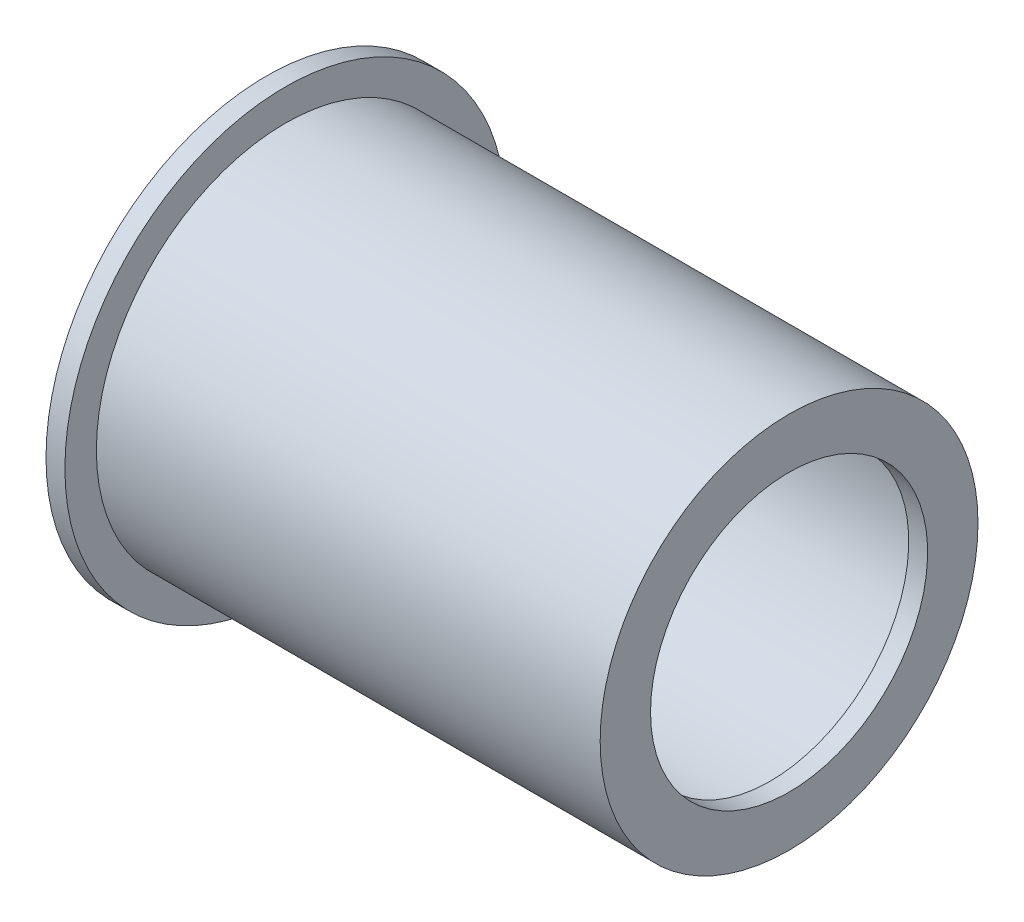
ISO-10303-21;
HEADER;
FILE_DESCRIPTION(('STEP AP214'),'2;1');
FILE_NAME('part.step','',(''),(''),'','','');
FILE_SCHEMA(('AUTOMOTIVE_DESIGN { 1 0 10303 214 1 1 1 1 }'));
ENDSEC;
DATA;
#1=APPLICATION_CONTEXT('core data for automotive mechanical design processes');
#2=APPLICATION_PROTOCOL_DEFINITION('international standard','automotive_design',2000,#1);
#3=PRODUCT_CONTEXT('',#1,'mechanical');
#4=PRODUCT('Part','Part','',(#3));
#5=PRODUCT_RELATED_PRODUCT_CATEGORY('part','',(#4));
#6=PRODUCT_DEFINITION_FORMATION('','',#4);
#7=PRODUCT_DEFINITION_CONTEXT('part definition',#1,'design');
#8=PRODUCT_DEFINITION('design','',#6,#7);
#9=PRODUCT_DEFINITION_SHAPE('','',#8);
#10=(LENGTH_UNIT() NAMED_UNIT(*) SI_UNIT(.MILLI.,.METRE.));
#11=(NAMED_UNIT(*) PLANE_ANGLE_UNIT() SI_UNIT($,.RADIAN.));
#12=(NAMED_UNIT(*) SI_UNIT($,.STERADIAN.) SOLID_ANGLE_UNIT());
#13=UNCERTAINTY_MEASURE_WITH_UNIT(LENGTH_MEASURE(1.E-05),#10,'distance_accuracy_value','');
#14=(GEOMETRIC_REPRESENTATION_CONTEXT(3) GLOBAL_UNCERTAINTY_ASSIGNED_CONTEXT((#13)) GLOBAL_UNIT_ASSIGNED_CONTEXT((#10,
#11,#12)) REPRESENTATION_CONTEXT('',''));
#15=CARTESIAN_POINT('',(0.,0.,0.));
#16=DIRECTION('',(0.,0.,1.));
#17=DIRECTION('',(1.,0.,0.));
#18=AXIS2_PLACEMENT_3D('',#15,#16,#17);
#19=CARTESIAN_POINT('',(0.,0.,0.));
#20=DIRECTION('',(-1.,0.,0.));
#21=DIRECTION('',(0.,0.,1.));
#22=AXIS2_PLACEMENT_3D('',#19,#20,#21);
#23=CYLINDRICAL_SURFACE('',#22,27.);
#24=CARTESIAN_POINT('',(88.2184223409149,0.,0.));
#25=DIRECTION('',(-1.,0.,0.));
#26=DIRECTION('',(0.,0.,1.));
#27=AXIS2_PLACEMENT_3D('',#24,#25,#26);
#28=CIRCLE('',#27,27.);
#29=CARTESIAN_POINT('',(88.2184223409149,0.,27.));
#30=VERTEX_POINT('',#29);
#31=EDGE_CURVE('E39',#30,#30,#28,.T.);
#32=ORIENTED_EDGE('',*,*,#31,.F.);
#33=EDGE_LOOP('',(#32));
#34=FACE_BOUND('',#33,.T.);
#35=CARTESIAN_POINT('',(11.2184223409149,0.,0.));
#36=DIRECTION('',(-1.,0.,0.));
#37=DIRECTION('',(0.,0.,1.));
#38=AXIS2_PLACEMENT_3D('',#35,#36,#37);
#39=CIRCLE('',#38,27.);
#40=CARTESIAN_POINT('',(11.2184223409149,0.,27.));
#41=VERTEX_POINT('',#40);
#42=EDGE_CURVE('E10',#41,#41,#39,.F.);
#43=ORIENTED_EDGE('',*,*,#42,.F.);
#44=EDGE_LOOP('',(#43));
#45=FACE_BOUND('',#44,.T.);
#46=ADVANCED_FACE('F32',(#34,#45),#23,.F.);
#47=CARTESIAN_POINT('',(88.2184223409149,27.,0.));
#48=DIRECTION('',(1.,0.,0.));
#49=DIRECTION('',(0.,0.,-1.));
#50=AXIS2_PLACEMENT_3D('',#47,#48,#49);
#51=PLANE('',#50);
#52=CARTESIAN_POINT('',(88.2184223409149,0.,0.));
#53=DIRECTION('',(-1.,0.,0.));
#54=DIRECTION('',(0.,0.,1.));
#55=AXIS2_PLACEMENT_3D('',#52,#53,#54);
#56=CIRCLE('',#55,22.);
#57=CARTESIAN_POINT('',(88.2184223409149,0.,22.));
#58=VERTEX_POINT('',#57);
#59=EDGE_CURVE('E61',#58,#58,#56,.T.);
#60=ORIENTED_EDGE('',*,*,#59,.F.);
#61=EDGE_LOOP('',(#60));
#62=FACE_BOUND('',#61,.T.);
#63=ORIENTED_EDGE('',*,*,#31,.T.);
#64=EDGE_LOOP('',(#63));
#65=FACE_BOUND('',#64,.T.);
#66=ADVANCED_FACE('F34',(#62,#65),#51,.F.);
#67=CARTESIAN_POINT('',(8.21842234091491,35.,0.));
#68=DIRECTION('',(1.,0.,0.));
#69=DIRECTION('',(0.,0.,-1.));
#70=AXIS2_PLACEMENT_3D('',#67,#68,#69);
#71=PLANE('',#70);
#72=CARTESIAN_POINT('',(8.21842234091491,0.,0.));
#73=DIRECTION('',(-1.,0.,0.));
#74=DIRECTION('',(0.,0.,1.));
#75=AXIS2_PLACEMENT_3D('',#72,#73,#74);
#76=CIRCLE('',#75,35.);
#77=CARTESIAN_POINT('',(8.21842234091491,0.,35.));
#78=VERTEX_POINT('',#77);
#79=EDGE_CURVE('E43',#78,#78,#76,.T.);
#80=ORIENTED_EDGE('',*,*,#79,.T.);
#81=EDGE_LOOP('',(#80));
#82=FACE_BOUND('',#81,.T.);
#83=ADVANCED_FACE('F69',(#82),#71,.F.);
#84=CARTESIAN_POINT('',(0.,0.,0.));
#85=DIRECTION('',(-1.,0.,0.));
#86=DIRECTION('',(0.,0.,1.));
#87=AXIS2_PLACEMENT_3D('',#84,#85,#86);
#88=CYLINDRICAL_SURFACE('',#87,35.);
#89=CARTESIAN_POINT('',(11.2184223409149,0.,0.));
#90=DIRECTION('',(-1.,0.,0.));
#91=DIRECTION('',(0.,0.,1.));
#92=AXIS2_PLACEMENT_3D('',#89,#90,#91);
#93=CIRCLE('',#92,35.);
#94=CARTESIAN_POINT('',(11.2184223409149,0.,35.));
#95=VERTEX_POINT('',#94);
#96=EDGE_CURVE('E47',#95,#95,#93,.T.);
#97=ORIENTED_EDGE('',*,*,#96,.T.);
#98=EDGE_LOOP('',(#97));
#99=FACE_BOUND('',#98,.T.);
#100=ORIENTED_EDGE('',*,*,#79,.F.);
#101=EDGE_LOOP('',(#100));
#102=FACE_BOUND('',#101,.T.);
#103=ADVANCED_FACE('F74',(#99,#102),#88,.T.);
#104=CARTESIAN_POINT('',(11.2184223409149,35.,0.));
#105=DIRECTION('',(1.,0.,0.));
#106=DIRECTION('',(0.,0.,-1.));
#107=AXIS2_PLACEMENT_3D('',#104,#105,#106);
#108=PLANE('',#107);
#109=CARTESIAN_POINT('',(11.2184223409149,0.,0.));
#110=DIRECTION('',(-1.,0.,0.));
#111=DIRECTION('',(0.,0.,1.));
#112=AXIS2_PLACEMENT_3D('',#109,#110,#111);
#113=CIRCLE('',#112,30.);
#114=CARTESIAN_POINT('',(11.2184223409149,0.,30.));
#115=VERTEX_POINT('',#114);
#116=EDGE_CURVE('E52',#115,#115,#113,.T.);
#117=ORIENTED_EDGE('',*,*,#116,.T.);
#118=EDGE_LOOP('',(#117));
#119=FACE_BOUND('',#118,.T.);
#120=ORIENTED_EDGE('',*,*,#96,.F.);
#121=EDGE_LOOP('',(#120));
#122=FACE_BOUND('',#121,.T.);
#123=ADVANCED_FACE('F84',(#119,#122),#108,.T.);
#124=CARTESIAN_POINT('',(0.,0.,0.));
#125=DIRECTION('',(-1.,0.,0.));
#126=DIRECTION('',(0.,0.,1.));
#127=AXIS2_PLACEMENT_3D('',#124,#125,#126);
#128=CYLINDRICAL_SURFACE('',#127,30.);
#129=CARTESIAN_POINT('',(91.2184223409149,0.,0.));
#130=DIRECTION('',(-1.,0.,0.));
#131=DIRECTION('',(0.,0.,1.));
#132=AXIS2_PLACEMENT_3D('',#129,#130,#131);
#133=CIRCLE('',#132,30.);
#134=CARTESIAN_POINT('',(91.2184223409149,0.,30.));
#135=VERTEX_POINT('',#134);
#136=EDGE_CURVE('E55',#135,#135,#133,.T.);
#137=ORIENTED_EDGE('',*,*,#136,.T.);
#138=EDGE_LOOP('',(#137));
#139=FACE_BOUND('',#138,.T.);
#140=ORIENTED_EDGE('',*,*,#116,.F.);
#141=EDGE_LOOP('',(#140));
#142=FACE_BOUND('',#141,.T.);
#143=ADVANCED_FACE('F88',(#139,#142),#128,.T.);
#144=CARTESIAN_POINT('',(91.2184223409149,27.,0.));
#145=DIRECTION('',(1.,0.,0.));
#146=DIRECTION('',(0.,0.,-1.));
#147=AXIS2_PLACEMENT_3D('',#144,#145,#146);
#148=PLANE('',#147);
#149=CARTESIAN_POINT('',(91.2184223409149,0.,0.));
#150=DIRECTION('',(-1.,0.,0.));
#151=DIRECTION('',(0.,0.,1.));
#152=AXIS2_PLACEMENT_3D('',#149,#150,#151);
#153=CIRCLE('',#152,22.);
#154=CARTESIAN_POINT('',(91.2184223409149,0.,22.));
#155=VERTEX_POINT('',#154);
#156=EDGE_CURVE('E58',#155,#155,#153,.T.);
#157=ORIENTED_EDGE('',*,*,#156,.T.);
#158=EDGE_LOOP('',(#157));
#159=FACE_BOUND('',#158,.T.);
#160=ORIENTED_EDGE('',*,*,#136,.F.);
#161=EDGE_LOOP('',(#160));
#162=FACE_BOUND('',#161,.T.);
#163=ADVANCED_FACE('F92',(#159,#162),#148,.T.);
#164=CARTESIAN_POINT('',(0.,0.,0.));
#165=DIRECTION('',(-1.,0.,0.));
#166=DIRECTION('',(0.,0.,1.));
#167=AXIS2_PLACEMENT_3D('',#164,#165,#166);
#168=CYLINDRICAL_SURFACE('',#167,22.);
#169=ORIENTED_EDGE('',*,*,#59,.T.);
#170=EDGE_LOOP('',(#169));
#171=FACE_BOUND('',#170,.T.);
#172=ORIENTED_EDGE('',*,*,#156,.F.);
#173=EDGE_LOOP('',(#172));
#174=FACE_BOUND('',#173,.T.);
#175=ADVANCED_FACE('F65',(#171,#174),#168,.F.);
#176=CARTESIAN_POINT('',(11.2184223409149,0.,0.));
#177=DIRECTION('',(-1.,0.,0.));
#178=DIRECTION('',(0.,0.,1.));
#179=AXIS2_PLACEMENT_3D('',#176,#177,#178);
#180=PLANE('',#179);
#181=ORIENTED_EDGE('',*,*,#42,.T.);
#182=EDGE_LOOP('',(#181));
#183=FACE_BOUND('',#182,.T.);
#184=ADVANCED_FACE('F99',(#183),#180,.F.);
#185=CLOSED_SHELL('',(#46,#66,#83,#103,#123,#143,#163,#175,#184));
#186=MANIFOLD_SOLID_BREP('B2',#185);
#187=ADVANCED_BREP_SHAPE_REPRESENTATION('',(#18,#186),#14);
#188=SHAPE_DEFINITION_REPRESENTATION(#9,#187);
ENDSEC;
END-ISO-10303-21;
